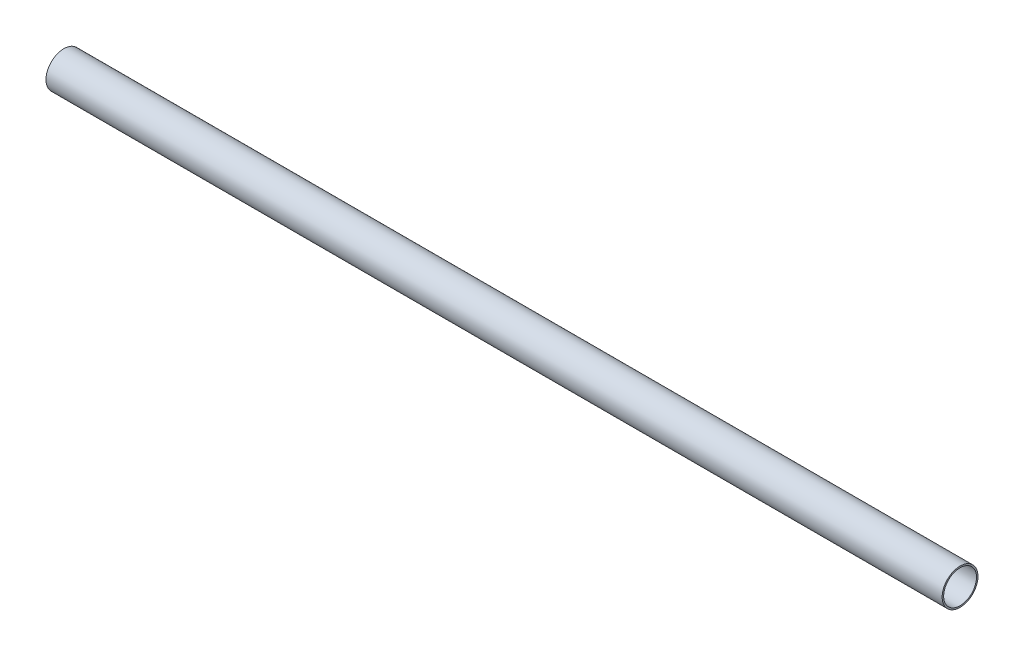
ISO-10303-21;
HEADER;
FILE_DESCRIPTION(('STEP AP214'),'2;1');
FILE_NAME('part.step','',(''),(''),'','','');
FILE_SCHEMA(('AUTOMOTIVE_DESIGN { 1 0 10303 214 1 1 1 1 }'));
ENDSEC;
DATA;
#1=APPLICATION_CONTEXT('core data for automotive mechanical design processes');
#2=APPLICATION_PROTOCOL_DEFINITION('international standard','automotive_design',2000,#1);
#3=PRODUCT_CONTEXT('',#1,'mechanical');
#4=PRODUCT('Part','Part','',(#3));
#5=PRODUCT_RELATED_PRODUCT_CATEGORY('part','',(#4));
#6=PRODUCT_DEFINITION_FORMATION('','',#4);
#7=PRODUCT_DEFINITION_CONTEXT('part definition',#1,'design');
#8=PRODUCT_DEFINITION('design','',#6,#7);
#9=PRODUCT_DEFINITION_SHAPE('','',#8);
#10=(LENGTH_UNIT() NAMED_UNIT(*) SI_UNIT(.MILLI.,.METRE.));
#11=(NAMED_UNIT(*) PLANE_ANGLE_UNIT() SI_UNIT($,.RADIAN.));
#12=(NAMED_UNIT(*) SI_UNIT($,.STERADIAN.) SOLID_ANGLE_UNIT());
#13=UNCERTAINTY_MEASURE_WITH_UNIT(LENGTH_MEASURE(1.E-05),#10,'distance_accuracy_value','');
#14=(GEOMETRIC_REPRESENTATION_CONTEXT(3) GLOBAL_UNCERTAINTY_ASSIGNED_CONTEXT((#13)) GLOBAL_UNIT_ASSIGNED_CONTEXT((#10,
#11,#12)) REPRESENTATION_CONTEXT('',''));
#15=CARTESIAN_POINT('',(0.,0.,0.));
#16=DIRECTION('',(0.,0.,1.));
#17=DIRECTION('',(1.,0.,0.));
#18=AXIS2_PLACEMENT_3D('',#15,#16,#17);
#19=CARTESIAN_POINT('',(-450.,-0.039,0.));
#20=DIRECTION('',(1.,0.,0.));
#21=DIRECTION('',(0.,0.,-1.));
#22=AXIS2_PLACEMENT_3D('',#19,#20,#21);
#23=CYLINDRICAL_SURFACE('',#22,5.99999999999998);
#24=CARTESIAN_POINT('',(-450.,-0.039,0.));
#25=DIRECTION('',(1.,0.,0.));
#26=DIRECTION('',(0.,0.,-1.));
#27=AXIS2_PLACEMENT_3D('',#24,#25,#26);
#28=CIRCLE('',#27,5.99999999999996);
#29=CARTESIAN_POINT('',(-450.,-0.039,-5.99999999999996));
#30=VERTEX_POINT('',#29);
#31=EDGE_CURVE('E10',#30,#30,#28,.T.);
#32=ORIENTED_EDGE('',*,*,#31,.T.);
#33=EDGE_LOOP('',(#32));
#34=FACE_BOUND('',#33,.T.);
#35=CARTESIAN_POINT('',(-150.,-0.039,0.));
#36=DIRECTION('',(1.,0.,0.));
#37=DIRECTION('',(0.,0.,-1.));
#38=AXIS2_PLACEMENT_3D('',#35,#36,#37);
#39=CIRCLE('',#38,6.);
#40=CARTESIAN_POINT('',(-150.,-0.039,-6.));
#41=VERTEX_POINT('',#40);
#42=EDGE_CURVE('E54',#41,#41,#39,.T.);
#43=ORIENTED_EDGE('',*,*,#42,.F.);
#44=EDGE_LOOP('',(#43));
#45=FACE_BOUND('',#44,.T.);
#46=ADVANCED_FACE('F37',(#34,#45),#23,.T.);
#47=CARTESIAN_POINT('',(-450.,5.96099999999996,0.));
#48=DIRECTION('',(-1.,0.,0.));
#49=DIRECTION('',(0.,0.,1.));
#50=AXIS2_PLACEMENT_3D('',#47,#48,#49);
#51=PLANE('',#50);
#52=CARTESIAN_POINT('',(-450.,-0.039,0.));
#53=DIRECTION('',(1.,0.,0.));
#54=DIRECTION('',(0.,0.,-1.));
#55=AXIS2_PLACEMENT_3D('',#52,#53,#54);
#56=CIRCLE('',#55,5.5);
#57=CARTESIAN_POINT('',(-450.,-0.039,-5.5));
#58=VERTEX_POINT('',#57);
#59=EDGE_CURVE('E44',#58,#58,#56,.T.);
#60=ORIENTED_EDGE('',*,*,#59,.T.);
#61=EDGE_LOOP('',(#60));
#62=FACE_BOUND('',#61,.T.);
#63=ORIENTED_EDGE('',*,*,#31,.F.);
#64=EDGE_LOOP('',(#63));
#65=FACE_BOUND('',#64,.T.);
#66=ADVANCED_FACE('F65',(#62,#65),#51,.T.);
#67=CARTESIAN_POINT('',(-450.,-0.039,0.));
#68=DIRECTION('',(1.,0.,0.));
#69=DIRECTION('',(0.,0.,-1.));
#70=AXIS2_PLACEMENT_3D('',#67,#68,#69);
#71=CYLINDRICAL_SURFACE('',#70,5.5);
#72=CARTESIAN_POINT('',(-150.,-0.039,0.));
#73=DIRECTION('',(1.,0.,0.));
#74=DIRECTION('',(0.,0.,-1.));
#75=AXIS2_PLACEMENT_3D('',#72,#73,#74);
#76=CIRCLE('',#75,5.5);
#77=CARTESIAN_POINT('',(-150.,-0.039,-5.5));
#78=VERTEX_POINT('',#77);
#79=EDGE_CURVE('E49',#78,#78,#76,.T.);
#80=ORIENTED_EDGE('',*,*,#79,.T.);
#81=EDGE_LOOP('',(#80));
#82=FACE_BOUND('',#81,.T.);
#83=ORIENTED_EDGE('',*,*,#59,.F.);
#84=EDGE_LOOP('',(#83));
#85=FACE_BOUND('',#84,.T.);
#86=ADVANCED_FACE('F69',(#82,#85),#71,.F.);
#87=CARTESIAN_POINT('',(-150.,5.461,0.));
#88=DIRECTION('',(1.,0.,0.));
#89=DIRECTION('',(0.,0.,-1.));
#90=AXIS2_PLACEMENT_3D('',#87,#88,#89);
#91=PLANE('',#90);
#92=ORIENTED_EDGE('',*,*,#42,.T.);
#93=EDGE_LOOP('',(#92));
#94=FACE_BOUND('',#93,.T.);
#95=ORIENTED_EDGE('',*,*,#79,.F.);
#96=EDGE_LOOP('',(#95));
#97=FACE_BOUND('',#96,.T.);
#98=ADVANCED_FACE('F61',(#94,#97),#91,.T.);
#99=CLOSED_SHELL('',(#46,#66,#86,#98));
#100=MANIFOLD_SOLID_BREP('B2',#99);
#101=ADVANCED_BREP_SHAPE_REPRESENTATION('',(#18,#100),#14);
#102=SHAPE_DEFINITION_REPRESENTATION(#9,#101);
ENDSEC;
END-ISO-10303-21;
